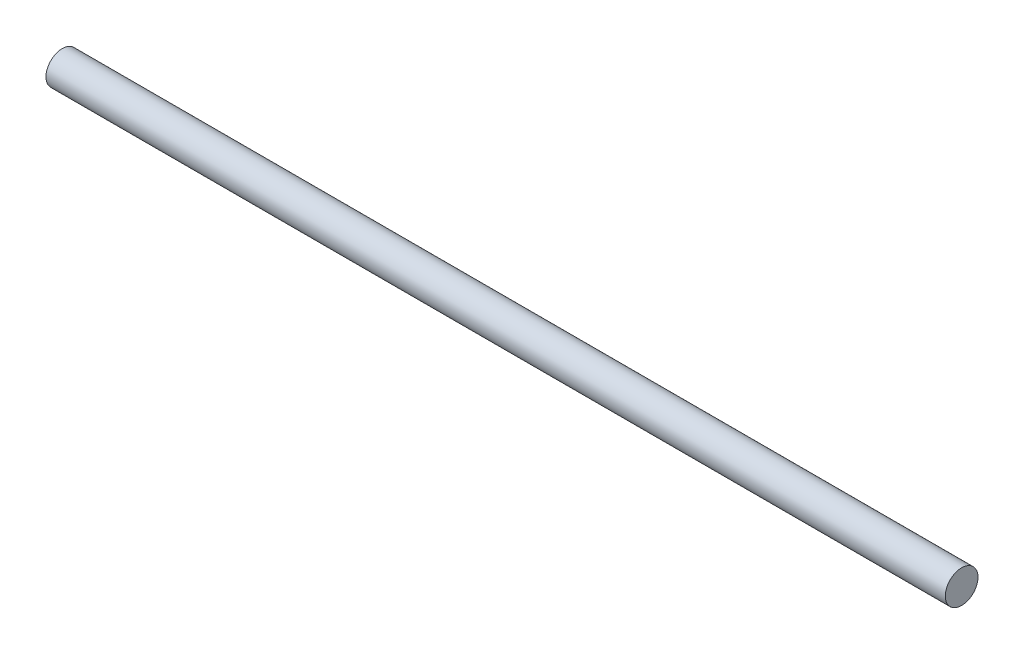
ISO-10303-21;
HEADER;
FILE_DESCRIPTION(('STEP AP214'),'2;1');
FILE_NAME('part.step','',(''),(''),'','','');
FILE_SCHEMA(('AUTOMOTIVE_DESIGN { 1 0 10303 214 1 1 1 1 }'));
ENDSEC;
DATA;
#1=APPLICATION_CONTEXT('core data for automotive mechanical design processes');
#2=APPLICATION_PROTOCOL_DEFINITION('international standard','automotive_design',2000,#1);
#3=PRODUCT_CONTEXT('',#1,'mechanical');
#4=PRODUCT('Part','Part','',(#3));
#5=PRODUCT_RELATED_PRODUCT_CATEGORY('part','',(#4));
#6=PRODUCT_DEFINITION_FORMATION('','',#4);
#7=PRODUCT_DEFINITION_CONTEXT('part definition',#1,'design');
#8=PRODUCT_DEFINITION('design','',#6,#7);
#9=PRODUCT_DEFINITION_SHAPE('','',#8);
#10=(LENGTH_UNIT() NAMED_UNIT(*) SI_UNIT(.MILLI.,.METRE.));
#11=(NAMED_UNIT(*) PLANE_ANGLE_UNIT() SI_UNIT($,.RADIAN.));
#12=(NAMED_UNIT(*) SI_UNIT($,.STERADIAN.) SOLID_ANGLE_UNIT());
#13=UNCERTAINTY_MEASURE_WITH_UNIT(LENGTH_MEASURE(1.E-05),#10,'distance_accuracy_value','');
#14=(GEOMETRIC_REPRESENTATION_CONTEXT(3) GLOBAL_UNCERTAINTY_ASSIGNED_CONTEXT((#13)) GLOBAL_UNIT_ASSIGNED_CONTEXT((#10,
#11,#12)) REPRESENTATION_CONTEXT('',''));
#15=CARTESIAN_POINT('',(0.,0.,0.));
#16=DIRECTION('',(0.,0.,1.));
#17=DIRECTION('',(1.,0.,0.));
#18=AXIS2_PLACEMENT_3D('',#15,#16,#17);
#19=CARTESIAN_POINT('',(108.293243741159,2.72965119205537,-1.02245132450207));
#20=DIRECTION('',(-1.,0.,0.));
#21=DIRECTION('',(0.,0.,1.));
#22=AXIS2_PLACEMENT_3D('',#19,#20,#21);
#23=CYLINDRICAL_SURFACE('',#22,4.);
#24=CARTESIAN_POINT('',(108.293243741159,2.72965119205537,-1.02245132450207));
#25=DIRECTION('',(1.,0.,0.));
#26=DIRECTION('',(0.,0.,-1.));
#27=AXIS2_PLACEMENT_3D('',#24,#25,#26);
#28=CIRCLE('',#27,4.);
#29=CARTESIAN_POINT('',(108.293243741159,2.72965119205537,-5.02245132450207));
#30=VERTEX_POINT('',#29);
#31=EDGE_CURVE('E9',#30,#30,#28,.T.);
#32=ORIENTED_EDGE('',*,*,#31,.F.);
#33=EDGE_LOOP('',(#32));
#34=FACE_BOUND('',#33,.T.);
#35=CARTESIAN_POINT('',(-111.706756258841,2.72965119205537,-1.02245132450207));
#36=DIRECTION('',(1.,0.,0.));
#37=DIRECTION('',(0.,0.,-1.));
#38=AXIS2_PLACEMENT_3D('',#35,#36,#37);
#39=CIRCLE('',#38,4.);
#40=CARTESIAN_POINT('',(-111.706756258841,2.72965119205537,-5.02245132450207));
#41=VERTEX_POINT('',#40);
#42=EDGE_CURVE('E17',#41,#41,#39,.T.);
#43=ORIENTED_EDGE('',*,*,#42,.T.);
#44=EDGE_LOOP('',(#43));
#45=FACE_BOUND('',#44,.T.);
#46=ADVANCED_FACE('F14',(#34,#45),#23,.T.);
#47=CARTESIAN_POINT('',(108.293243741159,2.72965119205537,-1.02245132450207));
#48=DIRECTION('',(1.,0.,0.));
#49=DIRECTION('',(0.,0.,-1.));
#50=AXIS2_PLACEMENT_3D('',#47,#48,#49);
#51=PLANE('',#50);
#52=ORIENTED_EDGE('',*,*,#31,.T.);
#53=EDGE_LOOP('',(#52));
#54=FACE_BOUND('',#53,.T.);
#55=ADVANCED_FACE('F29',(#54),#51,.T.);
#56=CARTESIAN_POINT('',(-111.706756258841,2.72965119205537,-1.02245132450207));
#57=DIRECTION('',(1.,0.,0.));
#58=DIRECTION('',(0.,0.,-1.));
#59=AXIS2_PLACEMENT_3D('',#56,#57,#58);
#60=PLANE('',#59);
#61=ORIENTED_EDGE('',*,*,#42,.F.);
#62=EDGE_LOOP('',(#61));
#63=FACE_BOUND('',#62,.T.);
#64=ADVANCED_FACE('F27',(#63),#60,.F.);
#65=CLOSED_SHELL('',(#46,#55,#64));
#66=MANIFOLD_SOLID_BREP('B1',#65);
#67=ADVANCED_BREP_SHAPE_REPRESENTATION('',(#18,#66),#14);
#68=SHAPE_DEFINITION_REPRESENTATION(#9,#67);
ENDSEC;
END-ISO-10303-21;
